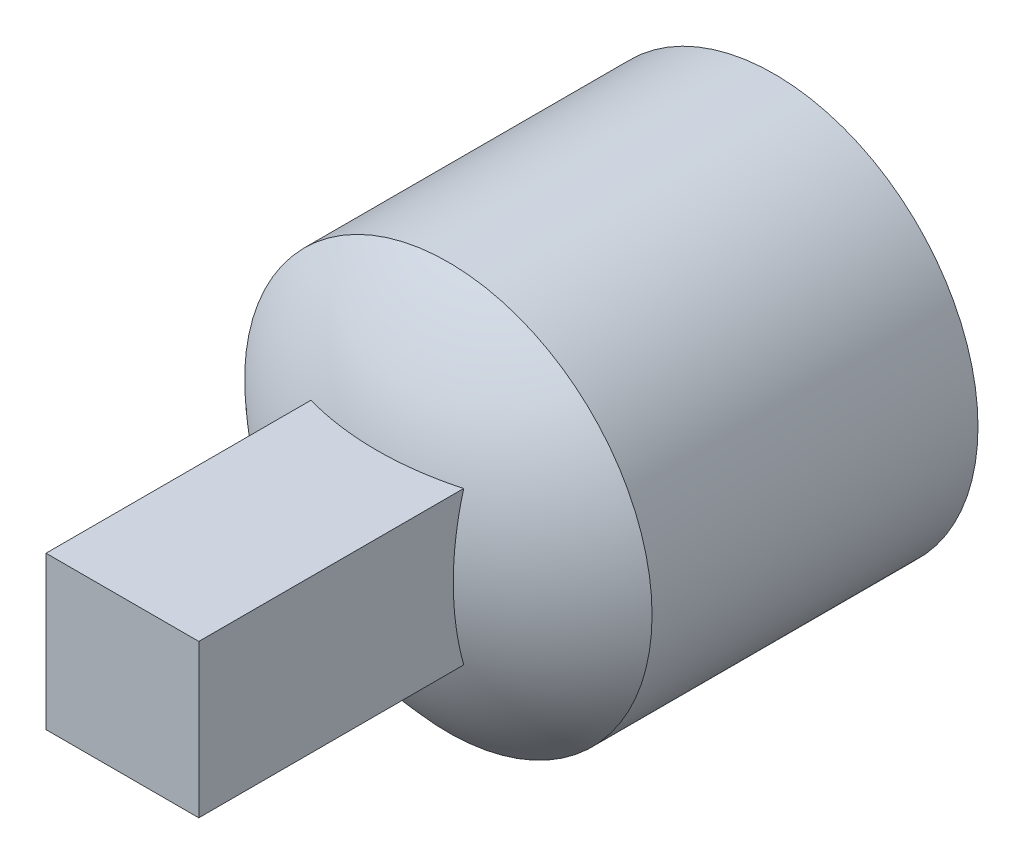
ISO-10303-21;
HEADER;
FILE_DESCRIPTION(('STEP AP214'),'2;1');
FILE_NAME('part.step','',(''),(''),'','','');
FILE_SCHEMA(('AUTOMOTIVE_DESIGN { 1 0 10303 214 1 1 1 1 }'));
ENDSEC;
DATA;
#1=APPLICATION_CONTEXT('core data for automotive mechanical design processes');
#2=APPLICATION_PROTOCOL_DEFINITION('international standard','automotive_design',2000,#1);
#3=PRODUCT_CONTEXT('',#1,'mechanical');
#4=PRODUCT('Part','Part','',(#3));
#5=PRODUCT_RELATED_PRODUCT_CATEGORY('part','',(#4));
#6=PRODUCT_DEFINITION_FORMATION('','',#4);
#7=PRODUCT_DEFINITION_CONTEXT('part definition',#1,'design');
#8=PRODUCT_DEFINITION('design','',#6,#7);
#9=PRODUCT_DEFINITION_SHAPE('','',#8);
#10=(LENGTH_UNIT() NAMED_UNIT(*) SI_UNIT(.MILLI.,.METRE.));
#11=(NAMED_UNIT(*) PLANE_ANGLE_UNIT() SI_UNIT($,.RADIAN.));
#12=(NAMED_UNIT(*) SI_UNIT($,.STERADIAN.) SOLID_ANGLE_UNIT());
#13=UNCERTAINTY_MEASURE_WITH_UNIT(LENGTH_MEASURE(1.E-05),#10,'distance_accuracy_value','');
#14=(GEOMETRIC_REPRESENTATION_CONTEXT(3) GLOBAL_UNCERTAINTY_ASSIGNED_CONTEXT((#13)) GLOBAL_UNIT_ASSIGNED_CONTEXT((#10,
#11,#12)) REPRESENTATION_CONTEXT('',''));
#15=CARTESIAN_POINT('',(0.,0.,0.));
#16=DIRECTION('',(0.,0.,1.));
#17=DIRECTION('',(1.,0.,0.));
#18=AXIS2_PLACEMENT_3D('',#15,#16,#17);
#19=CARTESIAN_POINT('',(0.,0.,0.));
#20=DIRECTION('',(0.,0.,1.));
#21=DIRECTION('',(1.,0.,0.));
#22=AXIS2_PLACEMENT_3D('',#19,#20,#21);
#23=PLANE('',#22);
#24=CARTESIAN_POINT('',(0.,0.,0.));
#25=DIRECTION('',(0.,0.,1.));
#26=DIRECTION('',(1.,0.,0.));
#27=AXIS2_PLACEMENT_3D('',#24,#25,#26);
#28=CIRCLE('',#27,6.35);
#29=CARTESIAN_POINT('',(6.35,0.,0.));
#30=VERTEX_POINT('',#29);
#31=EDGE_CURVE('E199',#30,#30,#28,.T.);
#32=ORIENTED_EDGE('',*,*,#31,.F.);
#33=EDGE_LOOP('',(#32));
#34=FACE_BOUND('',#33,.T.);
#35=DIRECTION('',(0.,1.,0.));
#36=VECTOR('',#35,1.);
#37=CARTESIAN_POINT('',(-1.90499999999999,-1.905,0.));
#38=LINE('',#37,#36);
#39=CARTESIAN_POINT('',(-1.90499999999999,-1.905,0.));
#40=VERTEX_POINT('',#39);
#41=CARTESIAN_POINT('',(-1.90499999999999,1.905,0.));
#42=VERTEX_POINT('',#41);
#43=EDGE_CURVE('E158',#40,#42,#38,.T.);
#44=ORIENTED_EDGE('',*,*,#43,.F.);
#45=DIRECTION('',(-1.,0.,0.));
#46=VECTOR('',#45,1.);
#47=CARTESIAN_POINT('',(1.90499999999999,-1.905,0.));
#48=LINE('',#47,#46);
#49=CARTESIAN_POINT('',(1.90499999999999,-1.905,0.));
#50=VERTEX_POINT('',#49);
#51=EDGE_CURVE('E169',#50,#40,#48,.T.);
#52=ORIENTED_EDGE('',*,*,#51,.F.);
#53=DIRECTION('',(0.,-1.,0.));
#54=VECTOR('',#53,1.);
#55=CARTESIAN_POINT('',(1.90499999999999,-1.905,0.));
#56=LINE('',#55,#54);
#57=CARTESIAN_POINT('',(1.90499999999999,1.905,0.));
#58=VERTEX_POINT('',#57);
#59=EDGE_CURVE('E165',#58,#50,#56,.T.);
#60=ORIENTED_EDGE('',*,*,#59,.F.);
#61=DIRECTION('',(1.,0.,0.));
#62=VECTOR('',#61,1.);
#63=CARTESIAN_POINT('',(1.90499999999999,1.905,0.));
#64=LINE('',#63,#62);
#65=EDGE_CURVE('E161',#42,#58,#64,.T.);
#66=ORIENTED_EDGE('',*,*,#65,.F.);
#67=EDGE_LOOP('',(#44,#52,#60,#66));
#68=FACE_BOUND('',#67,.T.);
#69=ADVANCED_FACE('F42',(#34,#68),#23,.F.);
#70=CARTESIAN_POINT('',(0.,0.,10.16));
#71=DIRECTION('',(0.,0.,-1.));
#72=DIRECTION('',(-1.,0.,0.));
#73=AXIS2_PLACEMENT_3D('',#70,#71,#72);
#74=CYLINDRICAL_SURFACE('',#73,6.35);
#75=CARTESIAN_POINT('',(-6.35000000000013,0.,5.55624999999997));
#76=CARTESIAN_POINT('',(-6.34999851693662,-0.0877105271754653,5.55624753859375));
#77=CARTESIAN_POINT('',(-6.3481646185618,-0.175448550370891,5.54895644209775));
#78=CARTESIAN_POINT('',(-6.34102653803297,-0.348410025990482,5.52002838153343));
#79=CARTESIAN_POINT('',(-6.33572038902813,-0.433632024604869,5.49838328657241));
#80=CARTESIAN_POINT('',(-6.32222537868089,-0.599038756393231,5.44148512341926));
#81=CARTESIAN_POINT('',(-6.3140399800787,-0.679229404630089,5.40624839635967));
#82=CARTESIAN_POINT('',(-6.29565822196363,-0.832561339598849,5.32322469553589));
#83=CARTESIAN_POINT('',(-6.28546179462216,-0.905702388435766,5.27543729844076));
#84=CARTESIAN_POINT('',(-6.26393012718005,-1.04436537306014,5.16762916428259));
#85=CARTESIAN_POINT('',(-6.25257731732196,-1.10972143864798,5.1073985831682));
#86=CARTESIAN_POINT('',(-6.23012914624375,-1.2295176146235,4.97686308313807));
#87=CARTESIAN_POINT('',(-6.21903381421832,-1.28395649243783,4.90655702821494));
#88=CARTESIAN_POINT('',(-6.19817970948859,-1.38115309112897,4.75657838503618));
#89=CARTESIAN_POINT('',(-6.18844324148051,-1.42372526185434,4.67678216405897));
#90=CARTESIAN_POINT('',(-6.17166548676264,-1.49478672821598,4.5108829309949));
#91=CARTESIAN_POINT('',(-6.16462376920368,-1.52327827533996,4.42478092973023));
#92=CARTESIAN_POINT('',(-6.15421337859408,-1.56480386895121,4.25053813106905));
#93=CARTESIAN_POINT('',(-6.15077394721487,-1.57813615065278,4.16247273501396));
#94=CARTESIAN_POINT('',(-6.14774575352437,-1.58989371194681,3.98529326446021));
#95=CARTESIAN_POINT('',(-6.14815636474815,-1.58832141675737,3.89617936292731));
#96=CARTESIAN_POINT('',(-6.15271825817254,-1.57055240524324,3.72171827013709));
#97=CARTESIAN_POINT('',(-6.1567786334365,-1.55471107670163,3.63633213394944));
#98=CARTESIAN_POINT('',(-6.1680376774094,-1.50942059780578,3.4694695544522));
#99=CARTESIAN_POINT('',(-6.17523656968987,-1.47997047802348,3.38799339012764));
#100=CARTESIAN_POINT('',(-6.19204495548597,-1.40799553081682,3.23031059946654));
#101=CARTESIAN_POINT('',(-6.20167804905132,-1.36534172282148,3.15416546818937));
#102=CARTESIAN_POINT('',(-6.22225610645753,-1.26826039211581,3.00998603217399));
#103=CARTESIAN_POINT('',(-6.23320129970928,-1.21383080915602,2.94195314996212));
#104=CARTESIAN_POINT('',(-6.25555306904602,-1.09290212445429,2.81389284005673));
#105=CARTESIAN_POINT('',(-6.26696390197516,-1.02610312322552,2.7541489980184));
#106=CARTESIAN_POINT('',(-6.28867980237542,-0.883297612691392,2.64665751839236));
#107=CARTESIAN_POINT('',(-6.29898483606459,-0.807290822240899,2.5989102472377));
#108=CARTESIAN_POINT('',(-6.31737933133005,-0.64782264885447,2.51666312957917));
#109=CARTESIAN_POINT('',(-6.3254610613517,-0.564336557812446,2.48220934823074));
#110=CARTESIAN_POINT('',(-6.33844212149245,-0.3925104419512,2.4279041847907));
#111=CARTESIAN_POINT('',(-6.34334206034067,-0.30417134910092,2.40805000945744));
#112=CARTESIAN_POINT('',(-6.34931736728866,-0.127571468662775,2.38394074311687));
#113=CARTESIAN_POINT('',(-6.35048739962922,-0.0393665286541849,2.37929946407031));
#114=CARTESIAN_POINT('',(-6.34914068428622,0.13655979249827,2.3846885271754));
#115=CARTESIAN_POINT('',(-6.34662426847617,0.224281216457207,2.39471754862905));
#116=CARTESIAN_POINT('',(-6.33824806693115,0.395408434455123,2.42884421138085));
#117=CARTESIAN_POINT('',(-6.33243837846644,0.478858917575256,2.45273117051315));
#118=CARTESIAN_POINT('',(-6.31813047854453,0.640563967845568,2.51365499726344));
#119=CARTESIAN_POINT('',(-6.30963199558132,0.718818009309545,2.55069319289808));
#120=CARTESIAN_POINT('',(-6.29066250888674,0.869445317271589,2.63761656972572));
#121=CARTESIAN_POINT('',(-6.2801591796333,0.941689592609567,2.68771805228656));
#122=CARTESIAN_POINT('',(-6.25839605556681,1.07688233277242,2.79906932014345));
#123=CARTESIAN_POINT('',(-6.24713613041388,1.1398291899131,2.86032102942787));
#124=CARTESIAN_POINT('',(-6.22478812783483,1.25623168454364,2.99402707522703));
#125=CARTESIAN_POINT('',(-6.21371105264867,1.30941642656663,3.06671948567754));
#126=CARTESIAN_POINT('',(-6.19329129615906,1.40283221995509,3.22022537147619));
#127=CARTESIAN_POINT('',(-6.18394853787603,1.44306384631715,3.30103848613237));
#128=CARTESIAN_POINT('',(-6.1681581692752,1.50913192014485,3.46805855622048));
#129=CARTESIAN_POINT('',(-6.16169345183928,1.53505365312555,3.55423007333072));
#130=CARTESIAN_POINT('',(-6.15237470828772,1.57199082345107,3.72989436676596));
#131=CARTESIAN_POINT('',(-6.149519892536,1.58300952074824,3.81938641234272));
#132=CARTESIAN_POINT('',(-6.14780437107522,1.58965750810348,3.99639475024676));
#133=CARTESIAN_POINT('',(-6.14883128804074,1.58571977515063,4.08389395217368));
#134=CARTESIAN_POINT('',(-6.15450370366628,1.56355761954778,4.25693828217362));
#135=CARTESIAN_POINT('',(-6.15914912960548,1.54533348401016,4.34248344948112));
#136=CARTESIAN_POINT('',(-6.17147250889214,1.49535231307696,4.50872061917756));
#137=CARTESIAN_POINT('',(-6.17913224458421,1.46367648662007,4.58943848137922));
#138=CARTESIAN_POINT('',(-6.19662374808772,1.3877553668987,4.74447169670531));
#139=CARTESIAN_POINT('',(-6.20645581711152,1.34350833028618,4.81878615995613));
#140=CARTESIAN_POINT('',(-6.22750462928883,1.24234336730764,4.96099531569379));
#141=CARTESIAN_POINT('',(-6.23875080280267,1.18512501408214,5.02867196937369));
#142=CARTESIAN_POINT('',(-6.26118495502317,1.06022708450915,5.1536039557418));
#143=CARTESIAN_POINT('',(-6.27237291927818,0.992545027501385,5.21085681020285));
#144=CARTESIAN_POINT('',(-6.29367185560455,0.847161529260243,5.31432696823085));
#145=CARTESIAN_POINT('',(-6.30375965312204,0.769300830284843,5.36032563280243));
#146=CARTESIAN_POINT('',(-6.32147712265329,0.606706579648587,5.43850773161207));
#147=CARTESIAN_POINT('',(-6.32910855503118,0.521978004637217,5.47070106501967));
#148=CARTESIAN_POINT('',(-6.33992529706876,0.364500851349341,5.51558018709886));
#149=CARTESIAN_POINT('',(-6.34367735847425,0.292502347544371,5.53079839889822));
#150=CARTESIAN_POINT('',(-6.34871523870473,0.147008925709231,5.55113395699989));
#151=CARTESIAN_POINT('',(-6.35000124302208,0.0735141206484347,5.55625206301475));
#152=CARTESIAN_POINT('',(-6.35000000000013,0.,5.55624999999997));
#153=B_SPLINE_CURVE_WITH_KNOTS('',3,(#75,#76,#77,#78,#79,#80,#81,#82,#83,#84,#85,#86,#87,#88,
#89,#90,#91,#92,#93,#94,#95,#96,#97,#98,#99,#100,#101,#102,#103,#104,#105,#106,#107,#108,#109,
#110,#111,#112,#113,#114,#115,#116,#117,#118,#119,#120,#121,#122,#123,#124,#125,#126,#127,#128,
#129,#130,#131,#132,#133,#134,#135,#136,#137,#138,#139,#140,#141,#142,#143,#144,#145,#146,#147,
#148,#149,#150,#151,#152),.UNSPECIFIED.,.T.,.F.,(4,2,2,2,2,2,2,2,2,2,2,2,2,2,2,2,2,2,2,2,2,2,2,
2,2,2,2,2,2,2,2,2,2,2,2,2,2,2,4),(0.,0.262862179032752,0.525873384966798,0.788569354919463,
1.0512741866792,1.3188361083764,1.58642822138901,1.85799568652647,2.12951971404248,
2.39560412313563,2.6616452366927,2.92123809332428,3.1808494450156,3.44308141999858,
3.70535931134942,3.97511588525548,4.2448806978248,4.51557209034647,4.78621167987148,
5.04992543637985,5.3136154534432,5.57339790527356,5.83320659749424,6.09762546839996,
6.36209000850152,6.63304605574735,6.90399007343227,7.17330136133188,7.44255372942133,
7.70407167588533,7.96558436678471,8.22554023925415,8.48553217944886,8.75230635033822,
9.01914386340359,9.29081396320398,9.56228893377597,9.78262207113776,10.0029386347888),.UNSPECIFIED.);
#154=CARTESIAN_POINT('',(-6.35000000000013,0.,5.55624999999997));
#155=VERTEX_POINT('',#154);
#156=EDGE_CURVE('E132',#155,#155,#153,.T.);
#157=ORIENTED_EDGE('',*,*,#156,.T.);
#158=EDGE_LOOP('',(#157));
#159=FACE_BOUND('',#158,.T.);
#160=CARTESIAN_POINT('',(0.,0.,10.16));
#161=DIRECTION('',(0.,0.,1.));
#162=DIRECTION('',(1.,0.,0.));
#163=AXIS2_PLACEMENT_3D('',#160,#161,#162);
#164=CIRCLE('',#163,6.35);
#165=CARTESIAN_POINT('',(6.35000000000006,0.,10.16));
#166=VERTEX_POINT('',#165);
#167=EDGE_CURVE('E203',#166,#166,#164,.T.);
#168=ORIENTED_EDGE('',*,*,#167,.F.);
#169=EDGE_LOOP('',(#168));
#170=FACE_BOUND('',#169,.T.);
#171=ORIENTED_EDGE('',*,*,#31,.T.);
#172=EDGE_LOOP('',(#171));
#173=FACE_BOUND('',#172,.T.);
#174=ADVANCED_FACE('F225',(#159,#170,#173),#74,.T.);
#175=CARTESIAN_POINT('',(0.,0.,3.49250000000001));
#176=DIRECTION('',(0.,0.,1.));
#177=DIRECTION('',(1.,0.,0.));
#178=AXIS2_PLACEMENT_3D('',#175,#176,#177);
#179=SPHERICAL_SURFACE('',#178,9.2075);
#180=CARTESIAN_POINT('',(-2.38125,0.,3.49249999999997));
#181=DIRECTION('',(-1.,0.,0.));
#182=DIRECTION('',(0.,0.,1.));
#183=AXIS2_PLACEMENT_3D('',#180,#181,#182);
#184=CIRCLE('',#183,8.89425121567296);
#185=CARTESIAN_POINT('',(-2.38125,2.38125,12.0620596809288));
#186=VERTEX_POINT('',#185);
#187=CARTESIAN_POINT('',(-2.38125,-2.38125,12.0620596809288));
#188=VERTEX_POINT('',#187);
#189=EDGE_CURVE('E11',#186,#188,#184,.F.);
#190=ORIENTED_EDGE('',*,*,#189,.F.);
#191=CARTESIAN_POINT('',(0.,2.38125,3.49250000000001));
#192=DIRECTION('',(0.,1.,0.));
#193=DIRECTION('',(0.,0.,1.));
#194=AXIS2_PLACEMENT_3D('',#191,#192,#193);
#195=CIRCLE('',#194,8.89425121567296);
#196=CARTESIAN_POINT('',(2.38125,2.38125,12.0620596809288));
#197=VERTEX_POINT('',#196);
#198=EDGE_CURVE('E110',#197,#186,#195,.F.);
#199=ORIENTED_EDGE('',*,*,#198,.F.);
#200=CARTESIAN_POINT('',(2.38125,0.,3.4925));
#201=DIRECTION('',(1.,0.,0.));
#202=DIRECTION('',(0.,0.,-1.));
#203=AXIS2_PLACEMENT_3D('',#200,#201,#202);
#204=CIRCLE('',#203,8.89425121567296);
#205=CARTESIAN_POINT('',(2.38125,-2.38125,12.0620596809288));
#206=VERTEX_POINT('',#205);
#207=EDGE_CURVE('E61',#206,#197,#204,.F.);
#208=ORIENTED_EDGE('',*,*,#207,.F.);
#209=CARTESIAN_POINT('',(0.,-2.38125,3.49250000000001));
#210=DIRECTION('',(0.,-1.,0.));
#211=DIRECTION('',(0.,0.,-1.));
#212=AXIS2_PLACEMENT_3D('',#209,#210,#211);
#213=CIRCLE('',#212,8.89425121567296);
#214=EDGE_CURVE('E51',#188,#206,#213,.F.);
#215=ORIENTED_EDGE('',*,*,#214,.F.);
#216=EDGE_LOOP('',(#190,#199,#208,#215));
#217=FACE_BOUND('',#216,.T.);
#218=ORIENTED_EDGE('',*,*,#167,.T.);
#219=EDGE_LOOP('',(#218));
#220=FACE_BOUND('',#219,.T.);
#221=ADVANCED_FACE('F44',(#217,#220),#179,.T.);
#222=CARTESIAN_POINT('',(-1.90499999999999,-1.905,0.));
#223=DIRECTION('',(1.,0.,0.));
#224=DIRECTION('',(0.,0.,-1.));
#225=AXIS2_PLACEMENT_3D('',#222,#223,#224);
#226=PLANE('',#225);
#227=CARTESIAN_POINT('',(-1.90499999999999,0.,3.96874999999999));
#228=DIRECTION('',(1.,0.,0.));
#229=DIRECTION('',(0.,0.,-1.));
#230=AXIS2_PLACEMENT_3D('',#227,#228,#229);
#231=CIRCLE('',#230,1.5875);
#232=CARTESIAN_POINT('',(-1.90499999999999,0.,2.38124999999999));
#233=VERTEX_POINT('',#232);
#234=EDGE_CURVE('E137',#233,#233,#231,.T.);
#235=ORIENTED_EDGE('',*,*,#234,.F.);
#236=EDGE_LOOP('',(#235));
#237=FACE_BOUND('',#236,.T.);
#238=DIRECTION('',(0.,1.,0.));
#239=VECTOR('',#238,1.);
#240=CARTESIAN_POINT('',(-1.90499999999999,-1.905,7.61999999999999));
#241=LINE('',#240,#239);
#242=CARTESIAN_POINT('',(-1.90499999999999,-1.905,7.61999999999999));
#243=VERTEX_POINT('',#242);
#244=CARTESIAN_POINT('',(-1.90499999999999,1.905,7.61999999999999));
#245=VERTEX_POINT('',#244);
#246=EDGE_CURVE('E151',#243,#245,#241,.T.);
#247=ORIENTED_EDGE('',*,*,#246,.F.);
#248=DIRECTION('',(0.,0.,1.));
#249=VECTOR('',#248,1.);
#250=CARTESIAN_POINT('',(-1.90499999999999,-1.905,0.));
#251=LINE('',#250,#249);
#252=EDGE_CURVE('E172',#40,#243,#251,.T.);
#253=ORIENTED_EDGE('',*,*,#252,.F.);
#254=ORIENTED_EDGE('',*,*,#43,.T.);
#255=DIRECTION('',(0.,0.,1.));
#256=VECTOR('',#255,1.);
#257=CARTESIAN_POINT('',(-1.90499999999999,1.905,0.));
#258=LINE('',#257,#256);
#259=EDGE_CURVE('E195',#42,#245,#258,.T.);
#260=ORIENTED_EDGE('',*,*,#259,.T.);
#261=EDGE_LOOP('',(#247,#253,#254,#260));
#262=FACE_BOUND('',#261,.T.);
#263=ADVANCED_FACE('F235',(#237,#262),#226,.T.);
#264=CARTESIAN_POINT('',(1.90499999999999,1.905,0.));
#265=DIRECTION('',(0.,-1.,0.));
#266=DIRECTION('',(0.,0.,-1.));
#267=AXIS2_PLACEMENT_3D('',#264,#265,#266);
#268=PLANE('',#267);
#269=DIRECTION('',(1.,0.,0.));
#270=VECTOR('',#269,1.);
#271=CARTESIAN_POINT('',(1.90499999999999,1.905,7.62));
#272=LINE('',#271,#270);
#273=CARTESIAN_POINT('',(1.90499999999999,1.905,7.62));
#274=VERTEX_POINT('',#273);
#275=EDGE_CURVE('E176',#245,#274,#272,.T.);
#276=ORIENTED_EDGE('',*,*,#275,.F.);
#277=ORIENTED_EDGE('',*,*,#259,.F.);
#278=ORIENTED_EDGE('',*,*,#65,.T.);
#279=DIRECTION('',(0.,0.,1.));
#280=VECTOR('',#279,1.);
#281=CARTESIAN_POINT('',(1.90499999999999,1.905,0.));
#282=LINE('',#281,#280);
#283=EDGE_CURVE('E191',#58,#274,#282,.T.);
#284=ORIENTED_EDGE('',*,*,#283,.T.);
#285=EDGE_LOOP('',(#276,#277,#278,#284));
#286=FACE_BOUND('',#285,.T.);
#287=ADVANCED_FACE('F239',(#286),#268,.T.);
#288=CARTESIAN_POINT('',(1.90499999999999,-1.905,0.));
#289=DIRECTION('',(-1.,0.,0.));
#290=DIRECTION('',(0.,0.,1.));
#291=AXIS2_PLACEMENT_3D('',#288,#289,#290);
#292=PLANE('',#291);
#293=DIRECTION('',(0.,-1.,0.));
#294=VECTOR('',#293,1.);
#295=CARTESIAN_POINT('',(1.90499999999999,-1.905,7.62));
#296=LINE('',#295,#294);
#297=CARTESIAN_POINT('',(1.90499999999999,-1.905,7.62));
#298=VERTEX_POINT('',#297);
#299=EDGE_CURVE('E179',#274,#298,#296,.T.);
#300=ORIENTED_EDGE('',*,*,#299,.F.);
#301=ORIENTED_EDGE('',*,*,#283,.F.);
#302=ORIENTED_EDGE('',*,*,#59,.T.);
#303=DIRECTION('',(0.,0.,1.));
#304=VECTOR('',#303,1.);
#305=CARTESIAN_POINT('',(1.90499999999999,-1.905,0.));
#306=LINE('',#305,#304);
#307=EDGE_CURVE('E187',#50,#298,#306,.T.);
#308=ORIENTED_EDGE('',*,*,#307,.T.);
#309=EDGE_LOOP('',(#300,#301,#302,#308));
#310=FACE_BOUND('',#309,.T.);
#311=ADVANCED_FACE('F243',(#310),#292,.T.);
#312=CARTESIAN_POINT('',(1.90499999999999,-1.905,0.));
#313=DIRECTION('',(0.,1.,0.));
#314=DIRECTION('',(0.,0.,1.));
#315=AXIS2_PLACEMENT_3D('',#312,#313,#314);
#316=PLANE('',#315);
#317=DIRECTION('',(-1.,0.,0.));
#318=VECTOR('',#317,1.);
#319=CARTESIAN_POINT('',(1.90499999999999,-1.905,7.62));
#320=LINE('',#319,#318);
#321=EDGE_CURVE('E162',#298,#243,#320,.T.);
#322=ORIENTED_EDGE('',*,*,#321,.F.);
#323=ORIENTED_EDGE('',*,*,#307,.F.);
#324=ORIENTED_EDGE('',*,*,#51,.T.);
#325=ORIENTED_EDGE('',*,*,#252,.T.);
#326=EDGE_LOOP('',(#322,#323,#324,#325));
#327=FACE_BOUND('',#326,.T.);
#328=ADVANCED_FACE('F247',(#327),#316,.T.);
#329=CARTESIAN_POINT('',(0.,0.,7.62));
#330=DIRECTION('',(0.,0.,1.));
#331=DIRECTION('',(1.,0.,0.));
#332=AXIS2_PLACEMENT_3D('',#329,#330,#331);
#333=PLANE('',#332);
#334=ORIENTED_EDGE('',*,*,#246,.T.);
#335=ORIENTED_EDGE('',*,*,#275,.T.);
#336=ORIENTED_EDGE('',*,*,#299,.T.);
#337=ORIENTED_EDGE('',*,*,#321,.T.);
#338=EDGE_LOOP('',(#334,#335,#336,#337));
#339=FACE_BOUND('',#338,.T.);
#340=ADVANCED_FACE('F251',(#339),#333,.F.);
#341=CARTESIAN_POINT('',(-2.38125,-2.38125,20.32));
#342=DIRECTION('',(-1.,0.,0.));
#343=DIRECTION('',(0.,0.,1.));
#344=AXIS2_PLACEMENT_3D('',#341,#342,#343);
#345=PLANE('',#344);
#346=DIRECTION('',(0.,0.,-1.));
#347=VECTOR('',#346,1.);
#348=CARTESIAN_POINT('',(-2.38125,2.38125,20.32));
#349=LINE('',#348,#347);
#350=CARTESIAN_POINT('',(-2.38125,2.38125,20.32));
#351=VERTEX_POINT('',#350);
#352=EDGE_CURVE('E105',#351,#186,#349,.T.);
#353=ORIENTED_EDGE('',*,*,#352,.T.);
#354=ORIENTED_EDGE('',*,*,#189,.T.);
#355=DIRECTION('',(0.,0.,-1.));
#356=VECTOR('',#355,1.);
#357=CARTESIAN_POINT('',(-2.38125,-2.38125,20.32));
#358=LINE('',#357,#356);
#359=CARTESIAN_POINT('',(-2.38125,-2.38125,20.32));
#360=VERTEX_POINT('',#359);
#361=EDGE_CURVE('E130',#360,#188,#358,.T.);
#362=ORIENTED_EDGE('',*,*,#361,.F.);
#363=DIRECTION('',(0.,1.,0.));
#364=VECTOR('',#363,1.);
#365=CARTESIAN_POINT('',(-2.38125,-2.38125,20.32));
#366=LINE('',#365,#364);
#367=EDGE_CURVE('E122',#360,#351,#366,.T.);
#368=ORIENTED_EDGE('',*,*,#367,.T.);
#369=EDGE_LOOP('',(#353,#354,#362,#368));
#370=FACE_BOUND('',#369,.T.);
#371=ADVANCED_FACE('F128',(#370),#345,.T.);
#372=CARTESIAN_POINT('',(2.38125,-2.38125,20.32));
#373=DIRECTION('',(0.,-1.,0.));
#374=DIRECTION('',(0.,0.,-1.));
#375=AXIS2_PLACEMENT_3D('',#372,#373,#374);
#376=PLANE('',#375);
#377=ORIENTED_EDGE('',*,*,#361,.T.);
#378=ORIENTED_EDGE('',*,*,#214,.T.);
#379=DIRECTION('',(0.,0.,-1.));
#380=VECTOR('',#379,1.);
#381=CARTESIAN_POINT('',(2.38125,-2.38125,20.32));
#382=LINE('',#381,#380);
#383=CARTESIAN_POINT('',(2.38125,-2.38125,20.32));
#384=VERTEX_POINT('',#383);
#385=EDGE_CURVE('E152',#384,#206,#382,.T.);
#386=ORIENTED_EDGE('',*,*,#385,.F.);
#387=DIRECTION('',(-1.,0.,0.));
#388=VECTOR('',#387,1.);
#389=CARTESIAN_POINT('',(2.38125,-2.38125,20.32));
#390=LINE('',#389,#388);
#391=EDGE_CURVE('E115',#384,#360,#390,.T.);
#392=ORIENTED_EDGE('',*,*,#391,.T.);
#393=EDGE_LOOP('',(#377,#378,#386,#392));
#394=FACE_BOUND('',#393,.T.);
#395=ADVANCED_FACE('F213',(#394),#376,.T.);
#396=CARTESIAN_POINT('',(2.38125,-2.38125,20.32));
#397=DIRECTION('',(1.,0.,0.));
#398=DIRECTION('',(0.,0.,-1.));
#399=AXIS2_PLACEMENT_3D('',#396,#397,#398);
#400=PLANE('',#399);
#401=ORIENTED_EDGE('',*,*,#385,.T.);
#402=ORIENTED_EDGE('',*,*,#207,.T.);
#403=DIRECTION('',(0.,0.,-1.));
#404=VECTOR('',#403,1.);
#405=CARTESIAN_POINT('',(2.38125,2.38125,20.32));
#406=LINE('',#405,#404);
#407=CARTESIAN_POINT('',(2.38125,2.38125,20.32));
#408=VERTEX_POINT('',#407);
#409=EDGE_CURVE('E114',#408,#197,#406,.T.);
#410=ORIENTED_EDGE('',*,*,#409,.F.);
#411=DIRECTION('',(0.,-1.,0.));
#412=VECTOR('',#411,1.);
#413=CARTESIAN_POINT('',(2.38125,-2.38125,20.32));
#414=LINE('',#413,#412);
#415=EDGE_CURVE('E125',#408,#384,#414,.T.);
#416=ORIENTED_EDGE('',*,*,#415,.T.);
#417=EDGE_LOOP('',(#401,#402,#410,#416));
#418=FACE_BOUND('',#417,.T.);
#419=ADVANCED_FACE('F215',(#418),#400,.T.);
#420=CARTESIAN_POINT('',(2.38125,2.38125,20.32));
#421=DIRECTION('',(0.,1.,0.));
#422=DIRECTION('',(0.,0.,1.));
#423=AXIS2_PLACEMENT_3D('',#420,#421,#422);
#424=PLANE('',#423);
#425=ORIENTED_EDGE('',*,*,#409,.T.);
#426=ORIENTED_EDGE('',*,*,#198,.T.);
#427=ORIENTED_EDGE('',*,*,#352,.F.);
#428=DIRECTION('',(1.,0.,0.));
#429=VECTOR('',#428,1.);
#430=CARTESIAN_POINT('',(2.38125,2.38125,20.32));
#431=LINE('',#430,#429);
#432=EDGE_CURVE('E109',#351,#408,#431,.T.);
#433=ORIENTED_EDGE('',*,*,#432,.T.);
#434=EDGE_LOOP('',(#425,#426,#427,#433));
#435=FACE_BOUND('',#434,.T.);
#436=ADVANCED_FACE('F108',(#435),#424,.T.);
#437=CARTESIAN_POINT('',(0.,0.,20.32));
#438=DIRECTION('',(0.,0.,1.));
#439=DIRECTION('',(1.,0.,0.));
#440=AXIS2_PLACEMENT_3D('',#437,#438,#439);
#441=PLANE('',#440);
#442=ORIENTED_EDGE('',*,*,#367,.F.);
#443=ORIENTED_EDGE('',*,*,#391,.F.);
#444=ORIENTED_EDGE('',*,*,#415,.F.);
#445=ORIENTED_EDGE('',*,*,#432,.F.);
#446=EDGE_LOOP('',(#442,#443,#444,#445));
#447=FACE_BOUND('',#446,.T.);
#448=ADVANCED_FACE('F120',(#447),#441,.T.);
#449=CARTESIAN_POINT('',(-14.605,0.,3.96875000000001));
#450=DIRECTION('',(1.,0.,0.));
#451=DIRECTION('',(0.,0.,-1.));
#452=AXIS2_PLACEMENT_3D('',#449,#450,#451);
#453=CYLINDRICAL_SURFACE('',#452,1.5875);
#454=ORIENTED_EDGE('',*,*,#234,.T.);
#455=EDGE_LOOP('',(#454));
#456=FACE_BOUND('',#455,.T.);
#457=ORIENTED_EDGE('',*,*,#156,.F.);
#458=EDGE_LOOP('',(#457));
#459=FACE_BOUND('',#458,.T.);
#460=ADVANCED_FACE('F284',(#456,#459),#453,.F.);
#461=CLOSED_SHELL('',(#69,#174,#221,#263,#287,#311,#328,#340,#371,#395,#419,#436,#448,#460));
#462=MANIFOLD_SOLID_BREP('B2',#461);
#463=ADVANCED_BREP_SHAPE_REPRESENTATION('',(#18,#462),#14);
#464=SHAPE_DEFINITION_REPRESENTATION(#9,#463);
ENDSEC;
END-ISO-10303-21;
